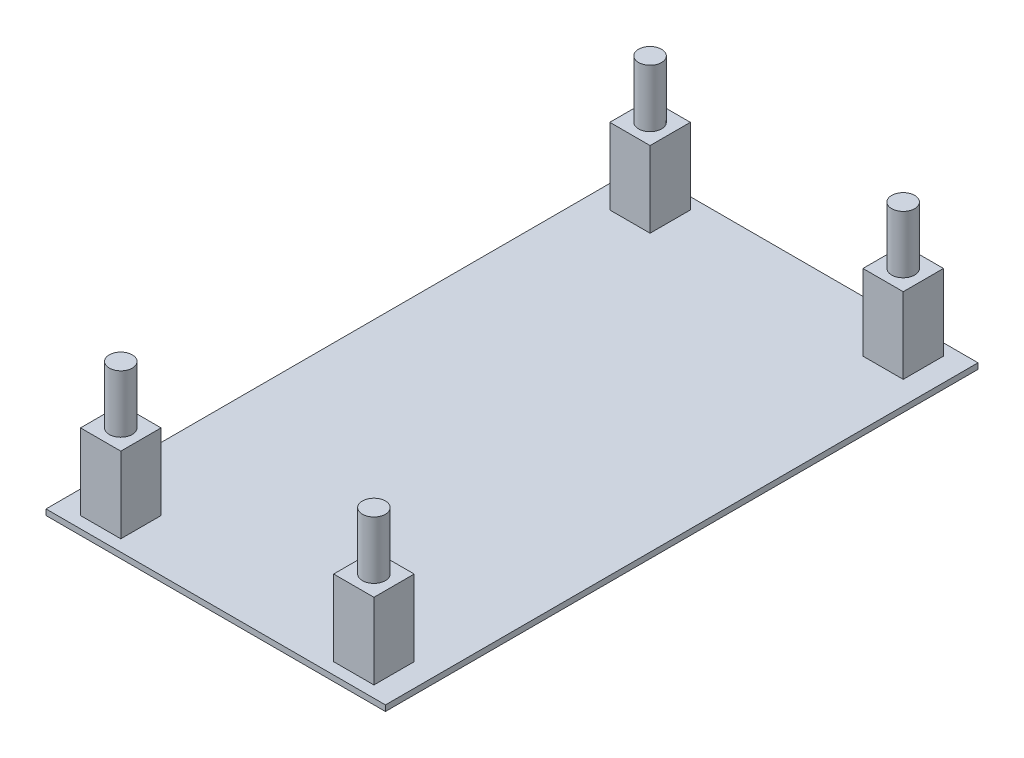
ISO-10303-21;
HEADER;
FILE_DESCRIPTION(('STEP AP214'),'2;1');
FILE_NAME('part.step','',(''),(''),'','','');
FILE_SCHEMA(('AUTOMOTIVE_DESIGN { 1 0 10303 214 1 1 1 1 }'));
ENDSEC;
DATA;
#1=APPLICATION_CONTEXT('core data for automotive mechanical design processes');
#2=APPLICATION_PROTOCOL_DEFINITION('international standard','automotive_design',2000,#1);
#3=PRODUCT_CONTEXT('',#1,'mechanical');
#4=PRODUCT('Part','Part','',(#3));
#5=PRODUCT_RELATED_PRODUCT_CATEGORY('part','',(#4));
#6=PRODUCT_DEFINITION_FORMATION('','',#4);
#7=PRODUCT_DEFINITION_CONTEXT('part definition',#1,'design');
#8=PRODUCT_DEFINITION('design','',#6,#7);
#9=PRODUCT_DEFINITION_SHAPE('','',#8);
#10=(LENGTH_UNIT() NAMED_UNIT(*) SI_UNIT(.MILLI.,.METRE.));
#11=(NAMED_UNIT(*) PLANE_ANGLE_UNIT() SI_UNIT($,.RADIAN.));
#12=(NAMED_UNIT(*) SI_UNIT($,.STERADIAN.) SOLID_ANGLE_UNIT());
#13=UNCERTAINTY_MEASURE_WITH_UNIT(LENGTH_MEASURE(1.E-05),#10,'distance_accuracy_value','');
#14=(GEOMETRIC_REPRESENTATION_CONTEXT(3) GLOBAL_UNCERTAINTY_ASSIGNED_CONTEXT((#13)) GLOBAL_UNIT_ASSIGNED_CONTEXT((#10,
#11,#12)) REPRESENTATION_CONTEXT('',''));
#15=CARTESIAN_POINT('',(0.,0.,0.));
#16=DIRECTION('',(0.,0.,1.));
#17=DIRECTION('',(1.,0.,0.));
#18=AXIS2_PLACEMENT_3D('',#15,#16,#17);
#19=CARTESIAN_POINT('',(-2.5,-141.412137681159,7.));
#20=DIRECTION('',(-1.,0.,0.));
#21=DIRECTION('',(0.,0.,1.));
#22=AXIS2_PLACEMENT_3D('',#19,#20,#21);
#23=PLANE('',#22);
#24=DIRECTION('',(0.,1.,0.));
#25=VECTOR('',#24,1.);
#26=CARTESIAN_POINT('',(-2.5,-141.412137681159,7.));
#27=LINE('',#26,#25);
#28=CARTESIAN_POINT('',(-2.49999999999999,-41.9121376811594,7.));
#29=VERTEX_POINT('',#28);
#30=CARTESIAN_POINT('',(-2.5,-41.4121376811594,7.));
#31=VERTEX_POINT('',#30);
#32=EDGE_CURVE('E186',#29,#31,#27,.T.);
#33=ORIENTED_EDGE('',*,*,#32,.F.);
#34=DIRECTION('',(0.,0.,-1.));
#35=VECTOR('',#34,1.);
#36=CARTESIAN_POINT('',(-2.49999999999999,-41.9121376811594,58.5));
#37=LINE('',#36,#35);
#38=CARTESIAN_POINT('',(-2.49999999999999,-41.9121376811594,58.5));
#39=VERTEX_POINT('',#38);
#40=EDGE_CURVE('E175',#39,#29,#37,.T.);
#41=ORIENTED_EDGE('',*,*,#40,.F.);
#42=DIRECTION('',(0.,1.,0.));
#43=VECTOR('',#42,1.);
#44=CARTESIAN_POINT('',(-2.49999999999999,-141.412137681159,58.5));
#45=LINE('',#44,#43);
#46=CARTESIAN_POINT('',(-2.49999999999999,-41.4121376811594,58.5));
#47=VERTEX_POINT('',#46);
#48=EDGE_CURVE('E44',#39,#47,#45,.T.);
#49=ORIENTED_EDGE('',*,*,#48,.T.);
#50=DIRECTION('',(0.,0.,1.));
#51=VECTOR('',#50,1.);
#52=CARTESIAN_POINT('',(-2.49999999999999,-41.4121376811594,61.));
#53=LINE('',#52,#51);
#54=EDGE_CURVE('E189',#31,#47,#53,.T.);
#55=ORIENTED_EDGE('',*,*,#54,.F.);
#56=EDGE_LOOP('',(#33,#41,#49,#55));
#57=FACE_BOUND('',#56,.T.);
#58=ADVANCED_FACE('F41',(#57),#23,.T.);
#59=CARTESIAN_POINT('',(-2.5,-141.412137681159,7.));
#60=DIRECTION('',(0.,0.,-1.));
#61=DIRECTION('',(-1.,0.,0.));
#62=AXIS2_PLACEMENT_3D('',#59,#60,#61);
#63=PLANE('',#62);
#64=DIRECTION('',(0.,1.,0.));
#65=VECTOR('',#64,1.);
#66=CARTESIAN_POINT('',(27.,-141.412137681159,7.));
#67=LINE('',#66,#65);
#68=CARTESIAN_POINT('',(27.,-41.9121376811594,7.));
#69=VERTEX_POINT('',#68);
#70=CARTESIAN_POINT('',(27.,-41.4121376811594,7.));
#71=VERTEX_POINT('',#70);
#72=EDGE_CURVE('E49',#69,#71,#67,.T.);
#73=ORIENTED_EDGE('',*,*,#72,.F.);
#74=DIRECTION('',(1.,0.,0.));
#75=VECTOR('',#74,1.);
#76=CARTESIAN_POINT('',(-2.49999999999999,-41.9121376811594,7.));
#77=LINE('',#76,#75);
#78=EDGE_CURVE('E178',#29,#69,#77,.T.);
#79=ORIENTED_EDGE('',*,*,#78,.F.);
#80=ORIENTED_EDGE('',*,*,#32,.T.);
#81=DIRECTION('',(-1.,0.,0.));
#82=VECTOR('',#81,1.);
#83=CARTESIAN_POINT('',(-50.7518115942029,-41.4121376811594,7.));
#84=LINE('',#83,#82);
#85=EDGE_CURVE('E202',#71,#31,#84,.T.);
#86=ORIENTED_EDGE('',*,*,#85,.F.);
#87=EDGE_LOOP('',(#73,#79,#80,#86));
#88=FACE_BOUND('',#87,.T.);
#89=ADVANCED_FACE('F184',(#88),#63,.T.);
#90=CARTESIAN_POINT('',(27.,-141.412137681159,7.));
#91=DIRECTION('',(1.,0.,0.));
#92=DIRECTION('',(0.,0.,-1.));
#93=AXIS2_PLACEMENT_3D('',#90,#91,#92);
#94=PLANE('',#93);
#95=DIRECTION('',(0.,1.,0.));
#96=VECTOR('',#95,1.);
#97=CARTESIAN_POINT('',(27.,-141.412137681159,58.5));
#98=LINE('',#97,#96);
#99=CARTESIAN_POINT('',(27.,-41.9121376811594,58.5));
#100=VERTEX_POINT('',#99);
#101=CARTESIAN_POINT('',(27.,-41.4121376811594,58.5));
#102=VERTEX_POINT('',#101);
#103=EDGE_CURVE('E11',#100,#102,#98,.T.);
#104=ORIENTED_EDGE('',*,*,#103,.F.);
#105=DIRECTION('',(0.,0.,1.));
#106=VECTOR('',#105,1.);
#107=CARTESIAN_POINT('',(27.,-41.9121376811594,58.5));
#108=LINE('',#107,#106);
#109=EDGE_CURVE('E56',#69,#100,#108,.T.);
#110=ORIENTED_EDGE('',*,*,#109,.F.);
#111=ORIENTED_EDGE('',*,*,#72,.T.);
#112=DIRECTION('',(0.,0.,-1.));
#113=VECTOR('',#112,1.);
#114=CARTESIAN_POINT('',(27.,-41.4121376811594,61.));
#115=LINE('',#114,#113);
#116=EDGE_CURVE('E198',#102,#71,#115,.T.);
#117=ORIENTED_EDGE('',*,*,#116,.F.);
#118=EDGE_LOOP('',(#104,#110,#111,#117));
#119=FACE_BOUND('',#118,.T.);
#120=ADVANCED_FACE('F391',(#119),#94,.T.);
#121=CARTESIAN_POINT('',(-2.49999999999999,-141.412137681159,58.5));
#122=DIRECTION('',(0.,0.,1.));
#123=DIRECTION('',(1.,0.,0.));
#124=AXIS2_PLACEMENT_3D('',#121,#122,#123);
#125=PLANE('',#124);
#126=ORIENTED_EDGE('',*,*,#48,.F.);
#127=DIRECTION('',(-1.,0.,0.));
#128=VECTOR('',#127,1.);
#129=CARTESIAN_POINT('',(-2.49999999999999,-41.9121376811594,58.5));
#130=LINE('',#129,#128);
#131=EDGE_CURVE('E179',#100,#39,#130,.T.);
#132=ORIENTED_EDGE('',*,*,#131,.F.);
#133=ORIENTED_EDGE('',*,*,#103,.T.);
#134=DIRECTION('',(1.,0.,0.));
#135=VECTOR('',#134,1.);
#136=CARTESIAN_POINT('',(-50.7518115942029,-41.4121376811594,58.5));
#137=LINE('',#136,#135);
#138=EDGE_CURVE('E195',#47,#102,#137,.T.);
#139=ORIENTED_EDGE('',*,*,#138,.F.);
#140=EDGE_LOOP('',(#126,#132,#133,#139));
#141=FACE_BOUND('',#140,.T.);
#142=ADVANCED_FACE('F395',(#141),#125,.T.);
#143=CARTESIAN_POINT('',(-50.7518115942029,-41.4121376811594,61.));
#144=DIRECTION('',(0.,1.,0.));
#145=DIRECTION('',(0.,0.,1.));
#146=AXIS2_PLACEMENT_3D('',#143,#144,#145);
#147=PLANE('',#146);
#148=DIRECTION('',(0.,0.,-1.));
#149=VECTOR('',#148,1.);
#150=CARTESIAN_POINT('',(21.5,-41.4121376811594,57.5));
#151=LINE('',#150,#149);
#152=CARTESIAN_POINT('',(21.5,-41.4121376811594,57.5));
#153=VERTEX_POINT('',#152);
#154=CARTESIAN_POINT('',(21.5,-41.4121376811594,54.));
#155=VERTEX_POINT('',#154);
#156=EDGE_CURVE('E250',#153,#155,#151,.T.);
#157=ORIENTED_EDGE('',*,*,#156,.T.);
#158=DIRECTION('',(-1.,0.,0.));
#159=VECTOR('',#158,1.);
#160=CARTESIAN_POINT('',(25.,-41.4121376811594,54.));
#161=LINE('',#160,#159);
#162=CARTESIAN_POINT('',(25.,-41.4121376811594,54.));
#163=VERTEX_POINT('',#162);
#164=EDGE_CURVE('E244',#163,#155,#161,.T.);
#165=ORIENTED_EDGE('',*,*,#164,.F.);
#166=DIRECTION('',(0.,0.,-1.));
#167=VECTOR('',#166,1.);
#168=CARTESIAN_POINT('',(25.,-41.4121376811594,57.5));
#169=LINE('',#168,#167);
#170=CARTESIAN_POINT('',(25.,-41.4121376811594,57.5));
#171=VERTEX_POINT('',#170);
#172=EDGE_CURVE('E236',#171,#163,#169,.T.);
#173=ORIENTED_EDGE('',*,*,#172,.F.);
#174=DIRECTION('',(-1.,0.,0.));
#175=VECTOR('',#174,1.);
#176=CARTESIAN_POINT('',(25.,-41.4121376811594,57.5));
#177=LINE('',#176,#175);
#178=EDGE_CURVE('E246',#171,#153,#177,.T.);
#179=ORIENTED_EDGE('',*,*,#178,.T.);
#180=EDGE_LOOP('',(#157,#165,#173,#179));
#181=FACE_BOUND('',#180,.T.);
#182=DIRECTION('',(0.,0.,1.));
#183=VECTOR('',#182,1.);
#184=CARTESIAN_POINT('',(21.5,-41.4121376811594,0.));
#185=LINE('',#184,#183);
#186=CARTESIAN_POINT('',(21.5,-41.4121376811594,8.));
#187=VERTEX_POINT('',#186);
#188=CARTESIAN_POINT('',(21.5,-41.4121376811594,11.5));
#189=VERTEX_POINT('',#188);
#190=EDGE_CURVE('E266',#187,#189,#185,.T.);
#191=ORIENTED_EDGE('',*,*,#190,.F.);
#192=DIRECTION('',(-1.,0.,0.));
#193=VECTOR('',#192,1.);
#194=CARTESIAN_POINT('',(0.,-41.4121376811594,8.));
#195=LINE('',#194,#193);
#196=CARTESIAN_POINT('',(25.,-41.4121376811594,8.));
#197=VERTEX_POINT('',#196);
#198=EDGE_CURVE('E278',#197,#187,#195,.T.);
#199=ORIENTED_EDGE('',*,*,#198,.F.);
#200=DIRECTION('',(0.,0.,1.));
#201=VECTOR('',#200,1.);
#202=CARTESIAN_POINT('',(25.,-41.4121376811594,0.));
#203=LINE('',#202,#201);
#204=CARTESIAN_POINT('',(25.,-41.4121376811594,11.5));
#205=VERTEX_POINT('',#204);
#206=EDGE_CURVE('E249',#197,#205,#203,.T.);
#207=ORIENTED_EDGE('',*,*,#206,.T.);
#208=DIRECTION('',(-1.,0.,0.));
#209=VECTOR('',#208,1.);
#210=CARTESIAN_POINT('',(0.,-41.4121376811594,11.5));
#211=LINE('',#210,#209);
#212=EDGE_CURVE('E280',#205,#189,#211,.T.);
#213=ORIENTED_EDGE('',*,*,#212,.T.);
#214=EDGE_LOOP('',(#191,#199,#207,#213));
#215=FACE_BOUND('',#214,.T.);
#216=DIRECTION('',(0.,0.,-1.));
#217=VECTOR('',#216,1.);
#218=CARTESIAN_POINT('',(3.,-41.4121376811594,0.));
#219=LINE('',#218,#217);
#220=CARTESIAN_POINT('',(3.,-41.4121376811594,57.5));
#221=VERTEX_POINT('',#220);
#222=CARTESIAN_POINT('',(3.,-41.4121376811594,54.));
#223=VERTEX_POINT('',#222);
#224=EDGE_CURVE('E343',#221,#223,#219,.T.);
#225=ORIENTED_EDGE('',*,*,#224,.F.);
#226=DIRECTION('',(1.,0.,0.));
#227=VECTOR('',#226,1.);
#228=CARTESIAN_POINT('',(0.,-41.4121376811594,57.5));
#229=LINE('',#228,#227);
#230=CARTESIAN_POINT('',(-0.499999999999997,-41.4121376811594,57.5));
#231=VERTEX_POINT('',#230);
#232=EDGE_CURVE('E201',#231,#221,#229,.T.);
#233=ORIENTED_EDGE('',*,*,#232,.F.);
#234=DIRECTION('',(0.,0.,-1.));
#235=VECTOR('',#234,1.);
#236=CARTESIAN_POINT('',(-0.499999999999997,-41.4121376811594,0.));
#237=LINE('',#236,#235);
#238=CARTESIAN_POINT('',(-0.499999999999994,-41.4121376811594,54.));
#239=VERTEX_POINT('',#238);
#240=EDGE_CURVE('E282',#231,#239,#237,.T.);
#241=ORIENTED_EDGE('',*,*,#240,.T.);
#242=DIRECTION('',(1.,0.,0.));
#243=VECTOR('',#242,1.);
#244=CARTESIAN_POINT('',(0.,-41.4121376811594,54.));
#245=LINE('',#244,#243);
#246=EDGE_CURVE('E318',#239,#223,#245,.T.);
#247=ORIENTED_EDGE('',*,*,#246,.T.);
#248=EDGE_LOOP('',(#225,#233,#241,#247));
#249=FACE_BOUND('',#248,.T.);
#250=DIRECTION('',(0.,0.,1.));
#251=VECTOR('',#250,1.);
#252=CARTESIAN_POINT('',(3.,-41.4121376811594,0.));
#253=LINE('',#252,#251);
#254=CARTESIAN_POINT('',(3.,-41.4121376811594,8.));
#255=VERTEX_POINT('',#254);
#256=CARTESIAN_POINT('',(3.,-41.4121376811594,11.5));
#257=VERTEX_POINT('',#256);
#258=EDGE_CURVE('E313',#255,#257,#253,.T.);
#259=ORIENTED_EDGE('',*,*,#258,.T.);
#260=DIRECTION('',(1.,0.,0.));
#261=VECTOR('',#260,1.);
#262=CARTESIAN_POINT('',(0.,-41.4121376811594,11.5));
#263=LINE('',#262,#261);
#264=CARTESIAN_POINT('',(-0.499999999999994,-41.4121376811594,11.5));
#265=VERTEX_POINT('',#264);
#266=EDGE_CURVE('E301',#265,#257,#263,.T.);
#267=ORIENTED_EDGE('',*,*,#266,.F.);
#268=DIRECTION('',(0.,0.,-1.));
#269=VECTOR('',#268,1.);
#270=CARTESIAN_POINT('',(-0.499999999999997,-41.4121376811594,0.));
#271=LINE('',#270,#269);
#272=CARTESIAN_POINT('',(-0.499999999999997,-41.4121376811594,8.));
#273=VERTEX_POINT('',#272);
#274=EDGE_CURVE('E310',#265,#273,#271,.T.);
#275=ORIENTED_EDGE('',*,*,#274,.T.);
#276=DIRECTION('',(1.,0.,0.));
#277=VECTOR('',#276,1.);
#278=CARTESIAN_POINT('',(0.,-41.4121376811594,8.));
#279=LINE('',#278,#277);
#280=EDGE_CURVE('E204',#273,#255,#279,.T.);
#281=ORIENTED_EDGE('',*,*,#280,.T.);
#282=EDGE_LOOP('',(#259,#267,#275,#281));
#283=FACE_BOUND('',#282,.T.);
#284=ORIENTED_EDGE('',*,*,#85,.T.);
#285=ORIENTED_EDGE('',*,*,#54,.T.);
#286=ORIENTED_EDGE('',*,*,#138,.T.);
#287=ORIENTED_EDGE('',*,*,#116,.T.);
#288=EDGE_LOOP('',(#284,#285,#286,#287));
#289=FACE_BOUND('',#288,.T.);
#290=ADVANCED_FACE('F366',(#181,#215,#249,#283,#289),#147,.T.);
#291=CARTESIAN_POINT('',(0.,-34.8121376811594,57.5));
#292=DIRECTION('',(0.,0.,-1.));
#293=DIRECTION('',(-1.,0.,0.));
#294=AXIS2_PLACEMENT_3D('',#291,#292,#293);
#295=PLANE('',#294);
#296=ORIENTED_EDGE('',*,*,#232,.T.);
#297=DIRECTION('',(0.,-1.,0.));
#298=VECTOR('',#297,1.);
#299=CARTESIAN_POINT('',(3.,-34.8121376811594,57.5));
#300=LINE('',#299,#298);
#301=CARTESIAN_POINT('',(3.,-34.8121376811594,57.5));
#302=VERTEX_POINT('',#301);
#303=EDGE_CURVE('E336',#302,#221,#300,.T.);
#304=ORIENTED_EDGE('',*,*,#303,.F.);
#305=DIRECTION('',(1.,0.,0.));
#306=VECTOR('',#305,1.);
#307=CARTESIAN_POINT('',(0.,-34.8121376811594,57.5));
#308=LINE('',#307,#306);
#309=CARTESIAN_POINT('',(-0.499999999999997,-34.8121376811594,57.5));
#310=VERTEX_POINT('',#309);
#311=EDGE_CURVE('E327',#310,#302,#308,.T.);
#312=ORIENTED_EDGE('',*,*,#311,.F.);
#313=DIRECTION('',(0.,-1.,0.));
#314=VECTOR('',#313,1.);
#315=CARTESIAN_POINT('',(-0.499999999999997,-34.8121376811594,57.5));
#316=LINE('',#315,#314);
#317=EDGE_CURVE('E342',#310,#231,#316,.T.);
#318=ORIENTED_EDGE('',*,*,#317,.T.);
#319=EDGE_LOOP('',(#296,#304,#312,#318));
#320=FACE_BOUND('',#319,.T.);
#321=ADVANCED_FACE('F363',(#320),#295,.F.);
#322=CARTESIAN_POINT('',(3.,-34.8121376811594,0.));
#323=DIRECTION('',(-1.,0.,0.));
#324=DIRECTION('',(0.,0.,1.));
#325=AXIS2_PLACEMENT_3D('',#322,#323,#324);
#326=PLANE('',#325);
#327=ORIENTED_EDGE('',*,*,#224,.T.);
#328=DIRECTION('',(0.,-1.,0.));
#329=VECTOR('',#328,1.);
#330=CARTESIAN_POINT('',(3.,-34.8121376811594,54.));
#331=LINE('',#330,#329);
#332=CARTESIAN_POINT('',(3.,-34.8121376811594,54.));
#333=VERTEX_POINT('',#332);
#334=EDGE_CURVE('E335',#333,#223,#331,.T.);
#335=ORIENTED_EDGE('',*,*,#334,.F.);
#336=DIRECTION('',(0.,0.,-1.));
#337=VECTOR('',#336,1.);
#338=CARTESIAN_POINT('',(3.,-34.8121376811594,0.));
#339=LINE('',#338,#337);
#340=EDGE_CURVE('E326',#302,#333,#339,.T.);
#341=ORIENTED_EDGE('',*,*,#340,.F.);
#342=ORIENTED_EDGE('',*,*,#303,.T.);
#343=EDGE_LOOP('',(#327,#335,#341,#342));
#344=FACE_BOUND('',#343,.T.);
#345=ADVANCED_FACE('F359',(#344),#326,.F.);
#346=CARTESIAN_POINT('',(0.,-34.8121376811594,54.));
#347=DIRECTION('',(0.,0.,-1.));
#348=DIRECTION('',(-1.,0.,0.));
#349=AXIS2_PLACEMENT_3D('',#346,#347,#348);
#350=PLANE('',#349);
#351=ORIENTED_EDGE('',*,*,#246,.F.);
#352=DIRECTION('',(0.,-1.,0.));
#353=VECTOR('',#352,1.);
#354=CARTESIAN_POINT('',(-0.499999999999997,-34.8121376811594,54.));
#355=LINE('',#354,#353);
#356=CARTESIAN_POINT('',(-0.499999999999997,-34.8121376811594,54.));
#357=VERTEX_POINT('',#356);
#358=EDGE_CURVE('E330',#357,#239,#355,.T.);
#359=ORIENTED_EDGE('',*,*,#358,.F.);
#360=DIRECTION('',(1.,0.,0.));
#361=VECTOR('',#360,1.);
#362=CARTESIAN_POINT('',(0.,-34.8121376811594,54.));
#363=LINE('',#362,#361);
#364=EDGE_CURVE('E332',#357,#333,#363,.T.);
#365=ORIENTED_EDGE('',*,*,#364,.T.);
#366=ORIENTED_EDGE('',*,*,#334,.T.);
#367=EDGE_LOOP('',(#351,#359,#365,#366));
#368=FACE_BOUND('',#367,.T.);
#369=ADVANCED_FACE('F370',(#368),#350,.T.);
#370=CARTESIAN_POINT('',(-0.499999999999997,-34.8121376811594,0.));
#371=DIRECTION('',(-1.,0.,0.));
#372=DIRECTION('',(0.,0.,1.));
#373=AXIS2_PLACEMENT_3D('',#370,#371,#372);
#374=PLANE('',#373);
#375=ORIENTED_EDGE('',*,*,#240,.F.);
#376=ORIENTED_EDGE('',*,*,#317,.F.);
#377=DIRECTION('',(0.,0.,-1.));
#378=VECTOR('',#377,1.);
#379=CARTESIAN_POINT('',(-0.499999999999997,-34.8121376811594,0.));
#380=LINE('',#379,#378);
#381=EDGE_CURVE('E337',#310,#357,#380,.T.);
#382=ORIENTED_EDGE('',*,*,#381,.T.);
#383=ORIENTED_EDGE('',*,*,#358,.T.);
#384=EDGE_LOOP('',(#375,#376,#382,#383));
#385=FACE_BOUND('',#384,.T.);
#386=ADVANCED_FACE('F376',(#385),#374,.T.);
#387=CARTESIAN_POINT('',(0.,-34.8121376811594,0.));
#388=DIRECTION('',(0.,1.,0.));
#389=DIRECTION('',(0.,0.,1.));
#390=AXIS2_PLACEMENT_3D('',#387,#388,#389);
#391=PLANE('',#390);
#392=CARTESIAN_POINT('',(1.25,-34.8121376811594,55.75));
#393=DIRECTION('',(0.,1.,0.));
#394=DIRECTION('',(0.,0.,1.));
#395=AXIS2_PLACEMENT_3D('',#392,#393,#394);
#396=CIRCLE('',#395,1.);
#397=CARTESIAN_POINT('',(1.25,-34.8121376811594,56.75));
#398=VERTEX_POINT('',#397);
#399=EDGE_CURVE('E226',#398,#398,#396,.T.);
#400=ORIENTED_EDGE('',*,*,#399,.F.);
#401=EDGE_LOOP('',(#400));
#402=FACE_BOUND('',#401,.T.);
#403=ORIENTED_EDGE('',*,*,#311,.T.);
#404=ORIENTED_EDGE('',*,*,#340,.T.);
#405=ORIENTED_EDGE('',*,*,#364,.F.);
#406=ORIENTED_EDGE('',*,*,#381,.F.);
#407=EDGE_LOOP('',(#403,#404,#405,#406));
#408=FACE_BOUND('',#407,.T.);
#409=ADVANCED_FACE('F374',(#402,#408),#391,.T.);
#410=CARTESIAN_POINT('',(3.,-34.8121376811594,0.));
#411=DIRECTION('',(1.,0.,0.));
#412=DIRECTION('',(0.,0.,-1.));
#413=AXIS2_PLACEMENT_3D('',#410,#411,#412);
#414=PLANE('',#413);
#415=ORIENTED_EDGE('',*,*,#258,.F.);
#416=DIRECTION('',(0.,-1.,0.));
#417=VECTOR('',#416,1.);
#418=CARTESIAN_POINT('',(3.,-34.8121376811594,8.));
#419=LINE('',#418,#417);
#420=CARTESIAN_POINT('',(3.,-34.8121376811594,8.));
#421=VERTEX_POINT('',#420);
#422=EDGE_CURVE('E295',#421,#255,#419,.T.);
#423=ORIENTED_EDGE('',*,*,#422,.F.);
#424=DIRECTION('',(0.,0.,1.));
#425=VECTOR('',#424,1.);
#426=CARTESIAN_POINT('',(3.,-34.8121376811594,0.));
#427=LINE('',#426,#425);
#428=CARTESIAN_POINT('',(3.,-34.8121376811594,11.5));
#429=VERTEX_POINT('',#428);
#430=EDGE_CURVE('E307',#421,#429,#427,.T.);
#431=ORIENTED_EDGE('',*,*,#430,.T.);
#432=DIRECTION('',(0.,-1.,0.));
#433=VECTOR('',#432,1.);
#434=CARTESIAN_POINT('',(3.,-34.8121376811594,11.5));
#435=LINE('',#434,#433);
#436=EDGE_CURVE('E305',#429,#257,#435,.T.);
#437=ORIENTED_EDGE('',*,*,#436,.T.);
#438=EDGE_LOOP('',(#415,#423,#431,#437));
#439=FACE_BOUND('',#438,.T.);
#440=ADVANCED_FACE('F383',(#439),#414,.T.);
#441=CARTESIAN_POINT('',(0.,-34.8121376811594,8.));
#442=DIRECTION('',(0.,0.,-1.));
#443=DIRECTION('',(-1.,0.,0.));
#444=AXIS2_PLACEMENT_3D('',#441,#442,#443);
#445=PLANE('',#444);
#446=ORIENTED_EDGE('',*,*,#280,.F.);
#447=DIRECTION('',(0.,-1.,0.));
#448=VECTOR('',#447,1.);
#449=CARTESIAN_POINT('',(-0.499999999999997,-34.8121376811594,8.));
#450=LINE('',#449,#448);
#451=CARTESIAN_POINT('',(-0.499999999999997,-34.8121376811594,8.));
#452=VERTEX_POINT('',#451);
#453=EDGE_CURVE('E299',#452,#273,#450,.T.);
#454=ORIENTED_EDGE('',*,*,#453,.F.);
#455=DIRECTION('',(1.,0.,0.));
#456=VECTOR('',#455,1.);
#457=CARTESIAN_POINT('',(0.,-34.8121376811594,8.));
#458=LINE('',#457,#456);
#459=EDGE_CURVE('E298',#452,#421,#458,.T.);
#460=ORIENTED_EDGE('',*,*,#459,.T.);
#461=ORIENTED_EDGE('',*,*,#422,.T.);
#462=EDGE_LOOP('',(#446,#454,#460,#461));
#463=FACE_BOUND('',#462,.T.);
#464=ADVANCED_FACE('F477',(#463),#445,.T.);
#465=CARTESIAN_POINT('',(-0.499999999999997,-34.8121376811594,0.));
#466=DIRECTION('',(-1.,0.,0.));
#467=DIRECTION('',(0.,0.,1.));
#468=AXIS2_PLACEMENT_3D('',#465,#466,#467);
#469=PLANE('',#468);
#470=ORIENTED_EDGE('',*,*,#274,.F.);
#471=DIRECTION('',(0.,-1.,0.));
#472=VECTOR('',#471,1.);
#473=CARTESIAN_POINT('',(-0.499999999999997,-34.8121376811594,11.5));
#474=LINE('',#473,#472);
#475=CARTESIAN_POINT('',(-0.499999999999997,-34.8121376811594,11.5));
#476=VERTEX_POINT('',#475);
#477=EDGE_CURVE('E302',#476,#265,#474,.T.);
#478=ORIENTED_EDGE('',*,*,#477,.F.);
#479=DIRECTION('',(0.,0.,-1.));
#480=VECTOR('',#479,1.);
#481=CARTESIAN_POINT('',(-0.499999999999997,-34.8121376811594,0.));
#482=LINE('',#481,#480);
#483=EDGE_CURVE('E297',#476,#452,#482,.T.);
#484=ORIENTED_EDGE('',*,*,#483,.T.);
#485=ORIENTED_EDGE('',*,*,#453,.T.);
#486=EDGE_LOOP('',(#470,#478,#484,#485));
#487=FACE_BOUND('',#486,.T.);
#488=ADVANCED_FACE('F481',(#487),#469,.T.);
#489=CARTESIAN_POINT('',(0.,-34.8121376811594,11.5));
#490=DIRECTION('',(0.,0.,-1.));
#491=DIRECTION('',(-1.,0.,0.));
#492=AXIS2_PLACEMENT_3D('',#489,#490,#491);
#493=PLANE('',#492);
#494=ORIENTED_EDGE('',*,*,#266,.T.);
#495=ORIENTED_EDGE('',*,*,#436,.F.);
#496=DIRECTION('',(1.,0.,0.));
#497=VECTOR('',#496,1.);
#498=CARTESIAN_POINT('',(0.,-34.8121376811594,11.5));
#499=LINE('',#498,#497);
#500=EDGE_CURVE('E287',#476,#429,#499,.T.);
#501=ORIENTED_EDGE('',*,*,#500,.F.);
#502=ORIENTED_EDGE('',*,*,#477,.T.);
#503=EDGE_LOOP('',(#494,#495,#501,#502));
#504=FACE_BOUND('',#503,.T.);
#505=ADVANCED_FACE('F485',(#504),#493,.F.);
#506=CARTESIAN_POINT('',(0.,-34.8121376811594,0.));
#507=DIRECTION('',(0.,1.,0.));
#508=DIRECTION('',(0.,0.,1.));
#509=AXIS2_PLACEMENT_3D('',#506,#507,#508);
#510=PLANE('',#509);
#511=CARTESIAN_POINT('',(1.25,-34.8121376811594,9.75));
#512=DIRECTION('',(0.,1.,0.));
#513=DIRECTION('',(0.,0.,1.));
#514=AXIS2_PLACEMENT_3D('',#511,#512,#513);
#515=CIRCLE('',#514,1.);
#516=CARTESIAN_POINT('',(1.25,-34.8121376811594,10.75));
#517=VERTEX_POINT('',#516);
#518=EDGE_CURVE('E218',#517,#517,#515,.T.);
#519=ORIENTED_EDGE('',*,*,#518,.F.);
#520=EDGE_LOOP('',(#519));
#521=FACE_BOUND('',#520,.T.);
#522=ORIENTED_EDGE('',*,*,#430,.F.);
#523=ORIENTED_EDGE('',*,*,#459,.F.);
#524=ORIENTED_EDGE('',*,*,#483,.F.);
#525=ORIENTED_EDGE('',*,*,#500,.T.);
#526=EDGE_LOOP('',(#522,#523,#524,#525));
#527=FACE_BOUND('',#526,.T.);
#528=ADVANCED_FACE('F459',(#521,#527),#510,.T.);
#529=CARTESIAN_POINT('',(0.,-34.8121376811594,8.));
#530=DIRECTION('',(0.,0.,1.));
#531=DIRECTION('',(1.,0.,0.));
#532=AXIS2_PLACEMENT_3D('',#529,#530,#531);
#533=PLANE('',#532);
#534=ORIENTED_EDGE('',*,*,#198,.T.);
#535=DIRECTION('',(0.,-1.,0.));
#536=VECTOR('',#535,1.);
#537=CARTESIAN_POINT('',(21.5,-34.8121376811594,8.));
#538=LINE('',#537,#536);
#539=CARTESIAN_POINT('',(21.5,-34.8121376811594,8.));
#540=VERTEX_POINT('',#539);
#541=EDGE_CURVE('E262',#540,#187,#538,.T.);
#542=ORIENTED_EDGE('',*,*,#541,.F.);
#543=DIRECTION('',(-1.,0.,0.));
#544=VECTOR('',#543,1.);
#545=CARTESIAN_POINT('',(0.,-34.8121376811594,8.));
#546=LINE('',#545,#544);
#547=CARTESIAN_POINT('',(25.,-34.8121376811594,8.));
#548=VERTEX_POINT('',#547);
#549=EDGE_CURVE('E274',#548,#540,#546,.T.);
#550=ORIENTED_EDGE('',*,*,#549,.F.);
#551=DIRECTION('',(0.,-1.,0.));
#552=VECTOR('',#551,1.);
#553=CARTESIAN_POINT('',(25.,-34.8121376811594,8.));
#554=LINE('',#553,#552);
#555=EDGE_CURVE('E275',#548,#197,#554,.T.);
#556=ORIENTED_EDGE('',*,*,#555,.T.);
#557=EDGE_LOOP('',(#534,#542,#550,#556));
#558=FACE_BOUND('',#557,.T.);
#559=ADVANCED_FACE('F455',(#558),#533,.F.);
#560=CARTESIAN_POINT('',(21.5,-34.8121376811594,0.));
#561=DIRECTION('',(1.,0.,0.));
#562=DIRECTION('',(0.,0.,-1.));
#563=AXIS2_PLACEMENT_3D('',#560,#561,#562);
#564=PLANE('',#563);
#565=ORIENTED_EDGE('',*,*,#190,.T.);
#566=DIRECTION('',(0.,-1.,0.));
#567=VECTOR('',#566,1.);
#568=CARTESIAN_POINT('',(21.5,-34.8121376811594,11.5));
#569=LINE('',#568,#567);
#570=CARTESIAN_POINT('',(21.5,-34.8121376811594,11.5));
#571=VERTEX_POINT('',#570);
#572=EDGE_CURVE('E267',#571,#189,#569,.T.);
#573=ORIENTED_EDGE('',*,*,#572,.F.);
#574=DIRECTION('',(0.,0.,1.));
#575=VECTOR('',#574,1.);
#576=CARTESIAN_POINT('',(21.5,-34.8121376811594,0.));
#577=LINE('',#576,#575);
#578=EDGE_CURVE('E255',#540,#571,#577,.T.);
#579=ORIENTED_EDGE('',*,*,#578,.F.);
#580=ORIENTED_EDGE('',*,*,#541,.T.);
#581=EDGE_LOOP('',(#565,#573,#579,#580));
#582=FACE_BOUND('',#581,.T.);
#583=ADVANCED_FACE('F458',(#582),#564,.F.);
#584=CARTESIAN_POINT('',(0.,-34.8121376811594,11.5));
#585=DIRECTION('',(0.,0.,1.));
#586=DIRECTION('',(1.,0.,0.));
#587=AXIS2_PLACEMENT_3D('',#584,#585,#586);
#588=PLANE('',#587);
#589=ORIENTED_EDGE('',*,*,#212,.F.);
#590=DIRECTION('',(0.,-1.,0.));
#591=VECTOR('',#590,1.);
#592=CARTESIAN_POINT('',(25.,-34.8121376811594,11.5));
#593=LINE('',#592,#591);
#594=CARTESIAN_POINT('',(25.,-34.8121376811594,11.5));
#595=VERTEX_POINT('',#594);
#596=EDGE_CURVE('E271',#595,#205,#593,.T.);
#597=ORIENTED_EDGE('',*,*,#596,.F.);
#598=DIRECTION('',(-1.,0.,0.));
#599=VECTOR('',#598,1.);
#600=CARTESIAN_POINT('',(0.,-34.8121376811594,11.5));
#601=LINE('',#600,#599);
#602=EDGE_CURVE('E265',#595,#571,#601,.T.);
#603=ORIENTED_EDGE('',*,*,#602,.T.);
#604=ORIENTED_EDGE('',*,*,#572,.T.);
#605=EDGE_LOOP('',(#589,#597,#603,#604));
#606=FACE_BOUND('',#605,.T.);
#607=ADVANCED_FACE('F463',(#606),#588,.T.);
#608=CARTESIAN_POINT('',(25.,-34.8121376811594,0.));
#609=DIRECTION('',(1.,0.,0.));
#610=DIRECTION('',(0.,0.,-1.));
#611=AXIS2_PLACEMENT_3D('',#608,#609,#610);
#612=PLANE('',#611);
#613=ORIENTED_EDGE('',*,*,#206,.F.);
#614=ORIENTED_EDGE('',*,*,#555,.F.);
#615=DIRECTION('',(0.,0.,1.));
#616=VECTOR('',#615,1.);
#617=CARTESIAN_POINT('',(25.,-34.8121376811594,0.));
#618=LINE('',#617,#616);
#619=EDGE_CURVE('E270',#548,#595,#618,.T.);
#620=ORIENTED_EDGE('',*,*,#619,.T.);
#621=ORIENTED_EDGE('',*,*,#596,.T.);
#622=EDGE_LOOP('',(#613,#614,#620,#621));
#623=FACE_BOUND('',#622,.T.);
#624=ADVANCED_FACE('F467',(#623),#612,.T.);
#625=CARTESIAN_POINT('',(0.,-34.8121376811594,0.));
#626=DIRECTION('',(0.,1.,0.));
#627=DIRECTION('',(0.,0.,1.));
#628=AXIS2_PLACEMENT_3D('',#625,#626,#627);
#629=PLANE('',#628);
#630=CARTESIAN_POINT('',(23.25,-34.8121376811594,9.75));
#631=DIRECTION('',(0.,1.,0.));
#632=DIRECTION('',(0.,0.,1.));
#633=AXIS2_PLACEMENT_3D('',#630,#631,#632);
#634=CIRCLE('',#633,1.);
#635=CARTESIAN_POINT('',(23.25,-34.8121376811594,10.75));
#636=VERTEX_POINT('',#635);
#637=EDGE_CURVE('E212',#636,#636,#634,.T.);
#638=ORIENTED_EDGE('',*,*,#637,.F.);
#639=EDGE_LOOP('',(#638));
#640=FACE_BOUND('',#639,.T.);
#641=ORIENTED_EDGE('',*,*,#549,.T.);
#642=ORIENTED_EDGE('',*,*,#578,.T.);
#643=ORIENTED_EDGE('',*,*,#602,.F.);
#644=ORIENTED_EDGE('',*,*,#619,.F.);
#645=EDGE_LOOP('',(#641,#642,#643,#644));
#646=FACE_BOUND('',#645,.T.);
#647=ADVANCED_FACE('F439',(#640,#646),#629,.T.);
#648=CARTESIAN_POINT('',(25.,-34.8121376811594,54.));
#649=DIRECTION('',(0.,0.,1.));
#650=DIRECTION('',(1.,0.,0.));
#651=AXIS2_PLACEMENT_3D('',#648,#649,#650);
#652=PLANE('',#651);
#653=ORIENTED_EDGE('',*,*,#164,.T.);
#654=DIRECTION('',(0.,-1.,0.));
#655=VECTOR('',#654,1.);
#656=CARTESIAN_POINT('',(21.5,-34.8121376811594,54.));
#657=LINE('',#656,#655);
#658=CARTESIAN_POINT('',(21.5,-34.8121376811594,54.));
#659=VERTEX_POINT('',#658);
#660=EDGE_CURVE('E230',#659,#155,#657,.T.);
#661=ORIENTED_EDGE('',*,*,#660,.F.);
#662=DIRECTION('',(-1.,0.,0.));
#663=VECTOR('',#662,1.);
#664=CARTESIAN_POINT('',(25.,-34.8121376811594,54.));
#665=LINE('',#664,#663);
#666=CARTESIAN_POINT('',(25.,-34.8121376811594,54.));
#667=VERTEX_POINT('',#666);
#668=EDGE_CURVE('E240',#667,#659,#665,.T.);
#669=ORIENTED_EDGE('',*,*,#668,.F.);
#670=DIRECTION('',(0.,-1.,0.));
#671=VECTOR('',#670,1.);
#672=CARTESIAN_POINT('',(25.,-34.8121376811594,54.));
#673=LINE('',#672,#671);
#674=EDGE_CURVE('E241',#667,#163,#673,.T.);
#675=ORIENTED_EDGE('',*,*,#674,.T.);
#676=EDGE_LOOP('',(#653,#661,#669,#675));
#677=FACE_BOUND('',#676,.T.);
#678=ADVANCED_FACE('F435',(#677),#652,.F.);
#679=CARTESIAN_POINT('',(21.5,-34.8121376811594,57.5));
#680=DIRECTION('',(-1.,0.,0.));
#681=DIRECTION('',(0.,0.,1.));
#682=AXIS2_PLACEMENT_3D('',#679,#680,#681);
#683=PLANE('',#682);
#684=ORIENTED_EDGE('',*,*,#156,.F.);
#685=DIRECTION('',(0.,-1.,0.));
#686=VECTOR('',#685,1.);
#687=CARTESIAN_POINT('',(21.5,-34.8121376811594,57.5));
#688=LINE('',#687,#686);
#689=CARTESIAN_POINT('',(21.5,-34.8121376811594,57.5));
#690=VERTEX_POINT('',#689);
#691=EDGE_CURVE('E234',#690,#153,#688,.T.);
#692=ORIENTED_EDGE('',*,*,#691,.F.);
#693=DIRECTION('',(0.,0.,-1.));
#694=VECTOR('',#693,1.);
#695=CARTESIAN_POINT('',(21.5,-34.8121376811594,57.5));
#696=LINE('',#695,#694);
#697=EDGE_CURVE('E233',#690,#659,#696,.T.);
#698=ORIENTED_EDGE('',*,*,#697,.T.);
#699=ORIENTED_EDGE('',*,*,#660,.T.);
#700=EDGE_LOOP('',(#684,#692,#698,#699));
#701=FACE_BOUND('',#700,.T.);
#702=ADVANCED_FACE('F438',(#701),#683,.T.);
#703=CARTESIAN_POINT('',(25.,-34.8121376811594,57.5));
#704=DIRECTION('',(0.,0.,1.));
#705=DIRECTION('',(1.,0.,0.));
#706=AXIS2_PLACEMENT_3D('',#703,#704,#705);
#707=PLANE('',#706);
#708=ORIENTED_EDGE('',*,*,#178,.F.);
#709=DIRECTION('',(0.,-1.,0.));
#710=VECTOR('',#709,1.);
#711=CARTESIAN_POINT('',(25.,-34.8121376811594,57.5));
#712=LINE('',#711,#710);
#713=CARTESIAN_POINT('',(25.,-34.8121376811594,57.5));
#714=VERTEX_POINT('',#713);
#715=EDGE_CURVE('E237',#714,#171,#712,.T.);
#716=ORIENTED_EDGE('',*,*,#715,.F.);
#717=DIRECTION('',(-1.,0.,0.));
#718=VECTOR('',#717,1.);
#719=CARTESIAN_POINT('',(25.,-34.8121376811594,57.5));
#720=LINE('',#719,#718);
#721=EDGE_CURVE('E232',#714,#690,#720,.T.);
#722=ORIENTED_EDGE('',*,*,#721,.T.);
#723=ORIENTED_EDGE('',*,*,#691,.T.);
#724=EDGE_LOOP('',(#708,#716,#722,#723));
#725=FACE_BOUND('',#724,.T.);
#726=ADVANCED_FACE('F443',(#725),#707,.T.);
#727=CARTESIAN_POINT('',(25.,-34.8121376811594,57.5));
#728=DIRECTION('',(-1.,0.,0.));
#729=DIRECTION('',(0.,0.,1.));
#730=AXIS2_PLACEMENT_3D('',#727,#728,#729);
#731=PLANE('',#730);
#732=ORIENTED_EDGE('',*,*,#172,.T.);
#733=ORIENTED_EDGE('',*,*,#674,.F.);
#734=DIRECTION('',(0.,0.,-1.));
#735=VECTOR('',#734,1.);
#736=CARTESIAN_POINT('',(25.,-34.8121376811594,57.5));
#737=LINE('',#736,#735);
#738=EDGE_CURVE('E229',#714,#667,#737,.T.);
#739=ORIENTED_EDGE('',*,*,#738,.F.);
#740=ORIENTED_EDGE('',*,*,#715,.T.);
#741=EDGE_LOOP('',(#732,#733,#739,#740));
#742=FACE_BOUND('',#741,.T.);
#743=ADVANCED_FACE('F447',(#742),#731,.F.);
#744=CARTESIAN_POINT('',(0.,-34.8121376811594,0.));
#745=DIRECTION('',(0.,-1.,0.));
#746=DIRECTION('',(0.,0.,-1.));
#747=AXIS2_PLACEMENT_3D('',#744,#745,#746);
#748=PLANE('',#747);
#749=CARTESIAN_POINT('',(23.25,-34.8121376811594,55.75));
#750=DIRECTION('',(0.,1.,0.));
#751=DIRECTION('',(0.,0.,1.));
#752=AXIS2_PLACEMENT_3D('',#749,#750,#751);
#753=CIRCLE('',#752,1.);
#754=CARTESIAN_POINT('',(23.25,-34.8121376811594,56.75));
#755=VERTEX_POINT('',#754);
#756=EDGE_CURVE('E206',#755,#755,#753,.T.);
#757=ORIENTED_EDGE('',*,*,#756,.F.);
#758=EDGE_LOOP('',(#757));
#759=FACE_BOUND('',#758,.T.);
#760=ORIENTED_EDGE('',*,*,#668,.T.);
#761=ORIENTED_EDGE('',*,*,#697,.F.);
#762=ORIENTED_EDGE('',*,*,#721,.F.);
#763=ORIENTED_EDGE('',*,*,#738,.T.);
#764=EDGE_LOOP('',(#760,#761,#762,#763));
#765=FACE_BOUND('',#764,.T.);
#766=ADVANCED_FACE('F433',(#759,#765),#748,.F.);
#767=CARTESIAN_POINT('',(1.25,-29.8121376811594,55.75));
#768=DIRECTION('',(0.,-1.,0.));
#769=DIRECTION('',(0.,0.,-1.));
#770=AXIS2_PLACEMENT_3D('',#767,#768,#769);
#771=CYLINDRICAL_SURFACE('',#770,1.);
#772=CARTESIAN_POINT('',(1.25,-29.8121376811594,55.75));
#773=DIRECTION('',(0.,1.,0.));
#774=DIRECTION('',(0.,0.,1.));
#775=AXIS2_PLACEMENT_3D('',#772,#773,#774);
#776=CIRCLE('',#775,1.);
#777=CARTESIAN_POINT('',(1.25,-29.8121376811594,56.75));
#778=VERTEX_POINT('',#777);
#779=EDGE_CURVE('E221',#778,#778,#776,.T.);
#780=ORIENTED_EDGE('',*,*,#779,.F.);
#781=EDGE_LOOP('',(#780));
#782=FACE_BOUND('',#781,.T.);
#783=ORIENTED_EDGE('',*,*,#399,.T.);
#784=EDGE_LOOP('',(#783));
#785=FACE_BOUND('',#784,.T.);
#786=ADVANCED_FACE('F429',(#782,#785),#771,.T.);
#787=CARTESIAN_POINT('',(1.25,-29.8121376811594,55.75));
#788=DIRECTION('',(0.,1.,0.));
#789=DIRECTION('',(0.,0.,1.));
#790=AXIS2_PLACEMENT_3D('',#787,#788,#789);
#791=PLANE('',#790);
#792=ORIENTED_EDGE('',*,*,#779,.T.);
#793=EDGE_LOOP('',(#792));
#794=FACE_BOUND('',#793,.T.);
#795=ADVANCED_FACE('F422',(#794),#791,.T.);
#796=CARTESIAN_POINT('',(1.25,-29.8121376811594,9.75));
#797=DIRECTION('',(0.,-1.,0.));
#798=DIRECTION('',(0.,0.,-1.));
#799=AXIS2_PLACEMENT_3D('',#796,#797,#798);
#800=CYLINDRICAL_SURFACE('',#799,1.);
#801=CARTESIAN_POINT('',(1.25,-29.8121376811594,9.75));
#802=DIRECTION('',(0.,1.,0.));
#803=DIRECTION('',(0.,0.,1.));
#804=AXIS2_PLACEMENT_3D('',#801,#802,#803);
#805=CIRCLE('',#804,1.);
#806=CARTESIAN_POINT('',(1.25,-29.8121376811594,10.75));
#807=VERTEX_POINT('',#806);
#808=EDGE_CURVE('E215',#807,#807,#805,.T.);
#809=ORIENTED_EDGE('',*,*,#808,.F.);
#810=EDGE_LOOP('',(#809));
#811=FACE_BOUND('',#810,.T.);
#812=ORIENTED_EDGE('',*,*,#518,.T.);
#813=EDGE_LOOP('',(#812));
#814=FACE_BOUND('',#813,.T.);
#815=ADVANCED_FACE('F419',(#811,#814),#800,.T.);
#816=CARTESIAN_POINT('',(1.25,-29.8121376811594,9.75));
#817=DIRECTION('',(0.,1.,0.));
#818=DIRECTION('',(0.,0.,1.));
#819=AXIS2_PLACEMENT_3D('',#816,#817,#818);
#820=PLANE('',#819);
#821=ORIENTED_EDGE('',*,*,#808,.T.);
#822=EDGE_LOOP('',(#821));
#823=FACE_BOUND('',#822,.T.);
#824=ADVANCED_FACE('F414',(#823),#820,.T.);
#825=CARTESIAN_POINT('',(23.25,-29.8121376811594,9.75));
#826=DIRECTION('',(0.,-1.,0.));
#827=DIRECTION('',(0.,0.,-1.));
#828=AXIS2_PLACEMENT_3D('',#825,#826,#827);
#829=CYLINDRICAL_SURFACE('',#828,1.);
#830=CARTESIAN_POINT('',(23.25,-29.8121376811594,9.75));
#831=DIRECTION('',(0.,1.,0.));
#832=DIRECTION('',(0.,0.,1.));
#833=AXIS2_PLACEMENT_3D('',#830,#831,#832);
#834=CIRCLE('',#833,1.);
#835=CARTESIAN_POINT('',(23.25,-29.8121376811594,10.75));
#836=VERTEX_POINT('',#835);
#837=EDGE_CURVE('E209',#836,#836,#834,.T.);
#838=ORIENTED_EDGE('',*,*,#837,.F.);
#839=EDGE_LOOP('',(#838));
#840=FACE_BOUND('',#839,.T.);
#841=ORIENTED_EDGE('',*,*,#637,.T.);
#842=EDGE_LOOP('',(#841));
#843=FACE_BOUND('',#842,.T.);
#844=ADVANCED_FACE('F411',(#840,#843),#829,.T.);
#845=CARTESIAN_POINT('',(23.25,-29.8121376811594,9.75));
#846=DIRECTION('',(0.,1.,0.));
#847=DIRECTION('',(0.,0.,1.));
#848=AXIS2_PLACEMENT_3D('',#845,#846,#847);
#849=PLANE('',#848);
#850=ORIENTED_EDGE('',*,*,#837,.T.);
#851=EDGE_LOOP('',(#850));
#852=FACE_BOUND('',#851,.T.);
#853=ADVANCED_FACE('F406',(#852),#849,.T.);
#854=CARTESIAN_POINT('',(23.25,-29.8121376811594,55.75));
#855=DIRECTION('',(0.,-1.,0.));
#856=DIRECTION('',(0.,0.,-1.));
#857=AXIS2_PLACEMENT_3D('',#854,#855,#856);
#858=CYLINDRICAL_SURFACE('',#857,1.);
#859=CARTESIAN_POINT('',(23.25,-29.8121376811594,55.75));
#860=DIRECTION('',(0.,1.,0.));
#861=DIRECTION('',(0.,0.,1.));
#862=AXIS2_PLACEMENT_3D('',#859,#860,#861);
#863=CIRCLE('',#862,1.);
#864=CARTESIAN_POINT('',(23.25,-29.8121376811594,56.75));
#865=VERTEX_POINT('',#864);
#866=EDGE_CURVE('E193',#865,#865,#863,.T.);
#867=ORIENTED_EDGE('',*,*,#866,.F.);
#868=EDGE_LOOP('',(#867));
#869=FACE_BOUND('',#868,.T.);
#870=ORIENTED_EDGE('',*,*,#756,.T.);
#871=EDGE_LOOP('',(#870));
#872=FACE_BOUND('',#871,.T.);
#873=ADVANCED_FACE('F402',(#869,#872),#858,.T.);
#874=CARTESIAN_POINT('',(23.25,-29.8121376811594,55.75));
#875=DIRECTION('',(0.,1.,0.));
#876=DIRECTION('',(0.,0.,1.));
#877=AXIS2_PLACEMENT_3D('',#874,#875,#876);
#878=PLANE('',#877);
#879=ORIENTED_EDGE('',*,*,#866,.T.);
#880=EDGE_LOOP('',(#879));
#881=FACE_BOUND('',#880,.T.);
#882=ADVANCED_FACE('F405',(#881),#878,.T.);
#883=CARTESIAN_POINT('',(0.,-41.9121376811594,0.));
#884=DIRECTION('',(0.,-1.,0.));
#885=DIRECTION('',(0.,0.,-1.));
#886=AXIS2_PLACEMENT_3D('',#883,#884,#885);
#887=PLANE('',#886);
#888=ORIENTED_EDGE('',*,*,#40,.T.);
#889=ORIENTED_EDGE('',*,*,#78,.T.);
#890=ORIENTED_EDGE('',*,*,#109,.T.);
#891=ORIENTED_EDGE('',*,*,#131,.T.);
#892=EDGE_LOOP('',(#888,#889,#890,#891));
#893=FACE_BOUND('',#892,.T.);
#894=ADVANCED_FACE('F177',(#893),#887,.T.);
#895=CLOSED_SHELL('',(#58,#89,#120,#142,#290,#321,#345,#369,#386,#409,#440,#464,#488,#505,#528,
#559,#583,#607,#624,#647,#678,#702,#726,#743,#766,#786,#795,#815,#824,#844,#853,#873,#882,#894));
#896=MANIFOLD_SOLID_BREP('B2',#895);
#897=ADVANCED_BREP_SHAPE_REPRESENTATION('',(#18,#896),#14);
#898=SHAPE_DEFINITION_REPRESENTATION(#9,#897);
ENDSEC;
END-ISO-10303-21;
